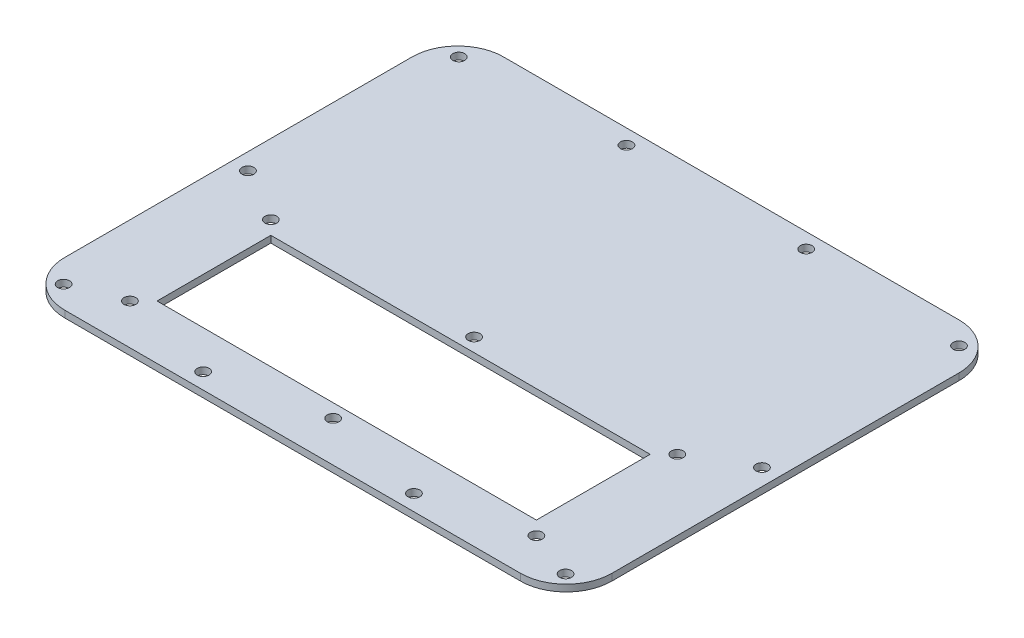
ISO-10303-21;
HEADER;
FILE_DESCRIPTION(('STEP AP214'),'2;1');
FILE_NAME('part.step','',(''),(''),'','','');
FILE_SCHEMA(('AUTOMOTIVE_DESIGN { 1 0 10303 214 1 1 1 1 }'));
ENDSEC;
DATA;
#1=APPLICATION_CONTEXT('core data for automotive mechanical design processes');
#2=APPLICATION_PROTOCOL_DEFINITION('international standard','automotive_design',2000,#1);
#3=PRODUCT_CONTEXT('',#1,'mechanical');
#4=PRODUCT('Part','Part','',(#3));
#5=PRODUCT_RELATED_PRODUCT_CATEGORY('part','',(#4));
#6=PRODUCT_DEFINITION_FORMATION('','',#4);
#7=PRODUCT_DEFINITION_CONTEXT('part definition',#1,'design');
#8=PRODUCT_DEFINITION('design','',#6,#7);
#9=PRODUCT_DEFINITION_SHAPE('','',#8);
#10=(LENGTH_UNIT() NAMED_UNIT(*) SI_UNIT(.MILLI.,.METRE.));
#11=(NAMED_UNIT(*) PLANE_ANGLE_UNIT() SI_UNIT($,.RADIAN.));
#12=(NAMED_UNIT(*) SI_UNIT($,.STERADIAN.) SOLID_ANGLE_UNIT());
#13=UNCERTAINTY_MEASURE_WITH_UNIT(LENGTH_MEASURE(1.E-05),#10,'distance_accuracy_value','');
#14=(GEOMETRIC_REPRESENTATION_CONTEXT(3) GLOBAL_UNCERTAINTY_ASSIGNED_CONTEXT((#13)) GLOBAL_UNIT_ASSIGNED_CONTEXT((#10,
#11,#12)) REPRESENTATION_CONTEXT('',''));
#15=CARTESIAN_POINT('',(0.,0.,0.));
#16=DIRECTION('',(0.,0.,1.));
#17=DIRECTION('',(1.,0.,0.));
#18=AXIS2_PLACEMENT_3D('',#15,#16,#17);
#19=CARTESIAN_POINT('',(-106.7689,3.175,81.3689000000001));
#20=DIRECTION('',(0.,-1.,0.));
#21=DIRECTION('',(0.,0.,-1.));
#22=AXIS2_PLACEMENT_3D('',#19,#20,#21);
#23=PLANE('',#22);
#24=CARTESIAN_POINT('',(-95.25,3.175,83.82));
#25=DIRECTION('',(0.,1.,0.));
#26=DIRECTION('',(0.,0.,-1.));
#27=AXIS2_PLACEMENT_3D('',#24,#25,#26);
#28=CIRCLE('',#27,2.7813);
#29=CARTESIAN_POINT('',(-95.25,3.175,81.0387));
#30=VERTEX_POINT('',#29);
#31=EDGE_CURVE('E465',#30,#30,#28,.T.);
#32=ORIENTED_EDGE('',*,*,#31,.F.);
#33=EDGE_LOOP('',(#32));
#34=FACE_BOUND('',#33,.T.);
#35=CARTESIAN_POINT('',(0.,3.175,83.82));
#36=DIRECTION('',(0.,1.,0.));
#37=DIRECTION('',(0.,0.,-1.));
#38=AXIS2_PLACEMENT_3D('',#35,#36,#37);
#39=CIRCLE('',#38,2.7813);
#40=CARTESIAN_POINT('',(0.,3.175,81.0387));
#41=VERTEX_POINT('',#40);
#42=EDGE_CURVE('E459',#41,#41,#39,.T.);
#43=ORIENTED_EDGE('',*,*,#42,.F.);
#44=EDGE_LOOP('',(#43));
#45=FACE_BOUND('',#44,.T.);
#46=CARTESIAN_POINT('',(95.25,3.175,83.82));
#47=DIRECTION('',(0.,1.,0.));
#48=DIRECTION('',(0.,0.,-1.));
#49=AXIS2_PLACEMENT_3D('',#46,#47,#48);
#50=CIRCLE('',#49,2.7813);
#51=CARTESIAN_POINT('',(95.25,3.175,81.0387));
#52=VERTEX_POINT('',#51);
#53=EDGE_CURVE('E453',#52,#52,#50,.T.);
#54=ORIENTED_EDGE('',*,*,#53,.F.);
#55=EDGE_LOOP('',(#54));
#56=FACE_BOUND('',#55,.T.);
#57=CARTESIAN_POINT('',(95.25,3.175,17.78));
#58=DIRECTION('',(0.,1.,0.));
#59=DIRECTION('',(0.,0.,1.));
#60=AXIS2_PLACEMENT_3D('',#57,#58,#59);
#61=CIRCLE('',#60,2.7813);
#62=CARTESIAN_POINT('',(95.25,3.175,20.5613));
#63=VERTEX_POINT('',#62);
#64=EDGE_CURVE('E447',#63,#63,#61,.T.);
#65=ORIENTED_EDGE('',*,*,#64,.F.);
#66=EDGE_LOOP('',(#65));
#67=FACE_BOUND('',#66,.T.);
#68=CARTESIAN_POINT('',(0.,3.175,17.78));
#69=DIRECTION('',(0.,1.,0.));
#70=DIRECTION('',(0.,0.,1.));
#71=AXIS2_PLACEMENT_3D('',#68,#69,#70);
#72=CIRCLE('',#71,2.7813);
#73=CARTESIAN_POINT('',(0.,3.175,20.5613));
#74=VERTEX_POINT('',#73);
#75=EDGE_CURVE('E434',#74,#74,#72,.T.);
#76=ORIENTED_EDGE('',*,*,#75,.F.);
#77=EDGE_LOOP('',(#76));
#78=FACE_BOUND('',#77,.T.);
#79=CARTESIAN_POINT('',(-95.25,3.175,17.78));
#80=DIRECTION('',(0.,1.,0.));
#81=DIRECTION('',(0.,0.,1.));
#82=AXIS2_PLACEMENT_3D('',#79,#80,#81);
#83=CIRCLE('',#82,2.7813);
#84=CARTESIAN_POINT('',(-95.25,3.175,20.5613));
#85=VERTEX_POINT('',#84);
#86=EDGE_CURVE('E160',#85,#85,#83,.T.);
#87=ORIENTED_EDGE('',*,*,#86,.F.);
#88=EDGE_LOOP('',(#87));
#89=FACE_BOUND('',#88,.T.);
#90=CARTESIAN_POINT('',(-42.1132000000002,3.175,-95.7452999999999));
#91=DIRECTION('',(0.,1.,0.));
#92=DIRECTION('',(0.,0.,-1.));
#93=AXIS2_PLACEMENT_3D('',#90,#91,#92);
#94=CIRCLE('',#93,2.7813);
#95=CARTESIAN_POINT('',(-42.1132000000002,3.175,-98.5265999999999));
#96=VERTEX_POINT('',#95);
#97=EDGE_CURVE('E170',#96,#96,#94,.T.);
#98=ORIENTED_EDGE('',*,*,#97,.F.);
#99=EDGE_LOOP('',(#98));
#100=FACE_BOUND('',#99,.T.);
#101=CARTESIAN_POINT('',(-117.221,3.175,-92.2908999999999));
#102=DIRECTION('',(0.,1.,0.));
#103=DIRECTION('',(0.,0.,-1.));
#104=AXIS2_PLACEMENT_3D('',#101,#102,#103);
#105=CIRCLE('',#104,2.7813);
#106=CARTESIAN_POINT('',(-117.221,3.175,-95.0721999999999));
#107=VERTEX_POINT('',#106);
#108=EDGE_CURVE('E176',#107,#107,#105,.T.);
#109=ORIENTED_EDGE('',*,*,#108,.F.);
#110=EDGE_LOOP('',(#109));
#111=FACE_BOUND('',#110,.T.);
#112=CARTESIAN_POINT('',(-120.4468,3.175,3.3147));
#113=DIRECTION('',(0.,1.,0.));
#114=DIRECTION('',(0.,0.,-1.));
#115=AXIS2_PLACEMENT_3D('',#112,#113,#114);
#116=CIRCLE('',#115,2.7813);
#117=CARTESIAN_POINT('',(-120.4468,3.175,0.533400000000007));
#118=VERTEX_POINT('',#117);
#119=EDGE_CURVE('E182',#118,#118,#116,.T.);
#120=ORIENTED_EDGE('',*,*,#119,.F.);
#121=EDGE_LOOP('',(#120));
#122=FACE_BOUND('',#121,.T.);
#123=CARTESIAN_POINT('',(-117.6274,3.175,92.5195));
#124=DIRECTION('',(0.,1.,0.));
#125=DIRECTION('',(0.,0.,-1.));
#126=AXIS2_PLACEMENT_3D('',#123,#124,#125);
#127=CIRCLE('',#126,2.7813);
#128=CARTESIAN_POINT('',(-117.6274,3.175,89.7381999999999));
#129=VERTEX_POINT('',#128);
#130=EDGE_CURVE('E188',#129,#129,#127,.T.);
#131=ORIENTED_EDGE('',*,*,#130,.F.);
#132=EDGE_LOOP('',(#131));
#133=FACE_BOUND('',#132,.T.);
#134=CARTESIAN_POINT('',(-49.4030000000002,3.175,95.3643));
#135=DIRECTION('',(0.,1.,0.));
#136=DIRECTION('',(0.,0.,-1.));
#137=AXIS2_PLACEMENT_3D('',#134,#135,#136);
#138=CIRCLE('',#137,2.7813);
#139=CARTESIAN_POINT('',(-49.4030000000002,3.175,92.583));
#140=VERTEX_POINT('',#139);
#141=EDGE_CURVE('E194',#140,#140,#138,.T.);
#142=ORIENTED_EDGE('',*,*,#141,.F.);
#143=EDGE_LOOP('',(#142));
#144=FACE_BOUND('',#143,.T.);
#145=CARTESIAN_POINT('',(49.403,3.175,95.3643));
#146=DIRECTION('',(0.,1.,0.));
#147=DIRECTION('',(0.,0.,1.));
#148=AXIS2_PLACEMENT_3D('',#145,#146,#147);
#149=CIRCLE('',#148,2.7813);
#150=CARTESIAN_POINT('',(49.403,3.175,98.1456));
#151=VERTEX_POINT('',#150);
#152=EDGE_CURVE('E200',#151,#151,#149,.T.);
#153=ORIENTED_EDGE('',*,*,#152,.F.);
#154=EDGE_LOOP('',(#153));
#155=FACE_BOUND('',#154,.T.);
#156=CARTESIAN_POINT('',(120.4468,3.175,3.3147));
#157=DIRECTION('',(0.,1.,0.));
#158=DIRECTION('',(0.,0.,1.));
#159=AXIS2_PLACEMENT_3D('',#156,#157,#158);
#160=CIRCLE('',#159,2.7813);
#161=CARTESIAN_POINT('',(120.4468,3.175,6.096));
#162=VERTEX_POINT('',#161);
#163=EDGE_CURVE('E206',#162,#162,#160,.T.);
#164=ORIENTED_EDGE('',*,*,#163,.F.);
#165=EDGE_LOOP('',(#164));
#166=FACE_BOUND('',#165,.T.);
#167=CARTESIAN_POINT('',(117.6274,3.175,92.5195));
#168=DIRECTION('',(0.,1.,0.));
#169=DIRECTION('',(0.,0.,1.));
#170=AXIS2_PLACEMENT_3D('',#167,#168,#169);
#171=CIRCLE('',#170,2.7813);
#172=CARTESIAN_POINT('',(117.6274,3.175,95.3008));
#173=VERTEX_POINT('',#172);
#174=EDGE_CURVE('E212',#173,#173,#171,.T.);
#175=ORIENTED_EDGE('',*,*,#174,.F.);
#176=EDGE_LOOP('',(#175));
#177=FACE_BOUND('',#176,.T.);
#178=CARTESIAN_POINT('',(117.221,3.175,-92.2909));
#179=DIRECTION('',(0.,1.,0.));
#180=DIRECTION('',(0.,0.,1.));
#181=AXIS2_PLACEMENT_3D('',#178,#179,#180);
#182=CIRCLE('',#181,2.7813);
#183=CARTESIAN_POINT('',(117.221,3.175,-89.5096));
#184=VERTEX_POINT('',#183);
#185=EDGE_CURVE('E218',#184,#184,#182,.T.);
#186=ORIENTED_EDGE('',*,*,#185,.F.);
#187=EDGE_LOOP('',(#186));
#188=FACE_BOUND('',#187,.T.);
#189=CARTESIAN_POINT('',(42.1132,3.175,-95.7453));
#190=DIRECTION('',(0.,1.,0.));
#191=DIRECTION('',(0.,0.,1.));
#192=AXIS2_PLACEMENT_3D('',#189,#190,#191);
#193=CIRCLE('',#192,2.7813);
#194=CARTESIAN_POINT('',(42.1132,3.175,-92.964));
#195=VERTEX_POINT('',#194);
#196=EDGE_CURVE('E224',#195,#195,#193,.T.);
#197=ORIENTED_EDGE('',*,*,#196,.F.);
#198=EDGE_LOOP('',(#197));
#199=FACE_BOUND('',#198,.T.);
#200=CARTESIAN_POINT('',(-106.7689,3.175,81.3689000000001));
#201=DIRECTION('',(0.,1.,0.));
#202=DIRECTION('',(0.,0.,-1.));
#203=AXIS2_PLACEMENT_3D('',#200,#201,#202);
#204=CIRCLE('',#203,21.4376);
#205=CARTESIAN_POINT('',(-128.2065,3.175,81.3688999999999));
#206=VERTEX_POINT('',#205);
#207=CARTESIAN_POINT('',(-106.7689,3.175,102.8065));
#208=VERTEX_POINT('',#207);
#209=EDGE_CURVE('E230',#206,#208,#204,.T.);
#210=ORIENTED_EDGE('',*,*,#209,.T.);
#211=DIRECTION('',(1.,0.,0.));
#212=VECTOR('',#211,1.);
#213=CARTESIAN_POINT('',(-106.7689,3.175,102.8065));
#214=LINE('',#213,#212);
#215=CARTESIAN_POINT('',(106.7689,3.175,102.8065));
#216=VERTEX_POINT('',#215);
#217=EDGE_CURVE('E233',#208,#216,#214,.T.);
#218=ORIENTED_EDGE('',*,*,#217,.T.);
#219=CARTESIAN_POINT('',(106.7689,3.175,81.3689000000001));
#220=DIRECTION('',(0.,1.,0.));
#221=DIRECTION('',(0.,0.,1.));
#222=AXIS2_PLACEMENT_3D('',#219,#220,#221);
#223=CIRCLE('',#222,21.4376);
#224=CARTESIAN_POINT('',(128.2065,3.175,81.3688999999999));
#225=VERTEX_POINT('',#224);
#226=EDGE_CURVE('E236',#216,#225,#223,.T.);
#227=ORIENTED_EDGE('',*,*,#226,.T.);
#228=DIRECTION('',(0.,0.,-1.));
#229=VECTOR('',#228,1.);
#230=CARTESIAN_POINT('',(128.2065,3.175,81.3688999999999));
#231=LINE('',#230,#229);
#232=CARTESIAN_POINT('',(128.2065,3.175,-81.3688999999998));
#233=VERTEX_POINT('',#232);
#234=EDGE_CURVE('E238',#225,#233,#231,.T.);
#235=ORIENTED_EDGE('',*,*,#234,.T.);
#236=CARTESIAN_POINT('',(106.7689,3.175,-81.3689));
#237=DIRECTION('',(0.,1.,0.));
#238=DIRECTION('',(0.,0.,-1.));
#239=AXIS2_PLACEMENT_3D('',#236,#237,#238);
#240=CIRCLE('',#239,21.4376);
#241=CARTESIAN_POINT('',(106.7689,3.175,-102.8065));
#242=VERTEX_POINT('',#241);
#243=EDGE_CURVE('E240',#233,#242,#240,.T.);
#244=ORIENTED_EDGE('',*,*,#243,.T.);
#245=DIRECTION('',(-1.,0.,0.));
#246=VECTOR('',#245,1.);
#247=CARTESIAN_POINT('',(-106.7689,3.175,-102.8065));
#248=LINE('',#247,#246);
#249=CARTESIAN_POINT('',(-106.7689,3.175,-102.8065));
#250=VERTEX_POINT('',#249);
#251=EDGE_CURVE('E242',#242,#250,#248,.T.);
#252=ORIENTED_EDGE('',*,*,#251,.T.);
#253=CARTESIAN_POINT('',(-106.7689,3.175,-81.3689));
#254=DIRECTION('',(0.,1.,0.));
#255=DIRECTION('',(0.,0.,-1.));
#256=AXIS2_PLACEMENT_3D('',#253,#254,#255);
#257=CIRCLE('',#256,21.4376);
#258=CARTESIAN_POINT('',(-128.2065,3.175,-81.3688999999998));
#259=VERTEX_POINT('',#258);
#260=EDGE_CURVE('E244',#250,#259,#257,.T.);
#261=ORIENTED_EDGE('',*,*,#260,.T.);
#262=DIRECTION('',(0.,0.,1.));
#263=VECTOR('',#262,1.);
#264=CARTESIAN_POINT('',(-128.2065,3.175,81.3688999999999));
#265=LINE('',#264,#263);
#266=EDGE_CURVE('E246',#259,#206,#265,.T.);
#267=ORIENTED_EDGE('',*,*,#266,.T.);
#268=EDGE_LOOP('',(#210,#218,#227,#235,#244,#252,#261,#267));
#269=FACE_BOUND('',#268,.T.);
#270=DIRECTION('',(0.,0.,-1.));
#271=VECTOR('',#270,1.);
#272=CARTESIAN_POINT('',(88.9,3.175,24.13));
#273=LINE('',#272,#271);
#274=CARTESIAN_POINT('',(88.9,3.175,77.47));
#275=VERTEX_POINT('',#274);
#276=CARTESIAN_POINT('',(88.9,3.175,24.13));
#277=VERTEX_POINT('',#276);
#278=EDGE_CURVE('E132',#275,#277,#273,.T.);
#279=ORIENTED_EDGE('',*,*,#278,.F.);
#280=DIRECTION('',(1.,0.,0.));
#281=VECTOR('',#280,1.);
#282=CARTESIAN_POINT('',(-88.9,3.175,77.47));
#283=LINE('',#282,#281);
#284=CARTESIAN_POINT('',(-88.9,3.175,77.47));
#285=VERTEX_POINT('',#284);
#286=EDGE_CURVE('E154',#285,#275,#283,.T.);
#287=ORIENTED_EDGE('',*,*,#286,.F.);
#288=DIRECTION('',(0.,0.,1.));
#289=VECTOR('',#288,1.);
#290=CARTESIAN_POINT('',(-88.9,3.175,24.13));
#291=LINE('',#290,#289);
#292=CARTESIAN_POINT('',(-88.9,3.175,24.13));
#293=VERTEX_POINT('',#292);
#294=EDGE_CURVE('E152',#293,#285,#291,.T.);
#295=ORIENTED_EDGE('',*,*,#294,.F.);
#296=DIRECTION('',(-1.,0.,0.));
#297=VECTOR('',#296,1.);
#298=CARTESIAN_POINT('',(-88.9,3.175,24.13));
#299=LINE('',#298,#297);
#300=EDGE_CURVE('E140',#277,#293,#299,.T.);
#301=ORIENTED_EDGE('',*,*,#300,.F.);
#302=EDGE_LOOP('',(#279,#287,#295,#301));
#303=FACE_BOUND('',#302,.T.);
#304=ADVANCED_FACE('F43',(#34,#45,#56,#67,#78,#89,#100,#111,#122,#133,#144,#155,#166,#177,#188,
#199,#269,#303),#23,.F.);
#305=CARTESIAN_POINT('',(-106.7689,0.,81.3689000000001));
#306=DIRECTION('',(0.,-1.,0.));
#307=DIRECTION('',(0.,0.,-1.));
#308=AXIS2_PLACEMENT_3D('',#305,#306,#307);
#309=PLANE('',#308);
#310=CARTESIAN_POINT('',(-95.25,0.,83.82));
#311=DIRECTION('',(0.,1.,0.));
#312=DIRECTION('',(0.,0.,-1.));
#313=AXIS2_PLACEMENT_3D('',#310,#311,#312);
#314=CIRCLE('',#313,2.7813);
#315=CARTESIAN_POINT('',(-95.25,0.,81.0387));
#316=VERTEX_POINT('',#315);
#317=EDGE_CURVE('E462',#316,#316,#314,.T.);
#318=ORIENTED_EDGE('',*,*,#317,.T.);
#319=EDGE_LOOP('',(#318));
#320=FACE_BOUND('',#319,.T.);
#321=CARTESIAN_POINT('',(0.,0.,83.82));
#322=DIRECTION('',(0.,1.,0.));
#323=DIRECTION('',(0.,0.,-1.));
#324=AXIS2_PLACEMENT_3D('',#321,#322,#323);
#325=CIRCLE('',#324,2.7813);
#326=CARTESIAN_POINT('',(0.,0.,81.0387));
#327=VERTEX_POINT('',#326);
#328=EDGE_CURVE('E456',#327,#327,#325,.T.);
#329=ORIENTED_EDGE('',*,*,#328,.T.);
#330=EDGE_LOOP('',(#329));
#331=FACE_BOUND('',#330,.T.);
#332=CARTESIAN_POINT('',(95.25,0.,83.82));
#333=DIRECTION('',(0.,1.,0.));
#334=DIRECTION('',(0.,0.,-1.));
#335=AXIS2_PLACEMENT_3D('',#332,#333,#334);
#336=CIRCLE('',#335,2.7813);
#337=CARTESIAN_POINT('',(95.25,0.,81.0387));
#338=VERTEX_POINT('',#337);
#339=EDGE_CURVE('E450',#338,#338,#336,.T.);
#340=ORIENTED_EDGE('',*,*,#339,.T.);
#341=EDGE_LOOP('',(#340));
#342=FACE_BOUND('',#341,.T.);
#343=CARTESIAN_POINT('',(95.25,0.,17.78));
#344=DIRECTION('',(0.,1.,0.));
#345=DIRECTION('',(0.,0.,1.));
#346=AXIS2_PLACEMENT_3D('',#343,#344,#345);
#347=CIRCLE('',#346,2.7813);
#348=CARTESIAN_POINT('',(95.25,0.,20.5613));
#349=VERTEX_POINT('',#348);
#350=EDGE_CURVE('E442',#349,#349,#347,.T.);
#351=ORIENTED_EDGE('',*,*,#350,.T.);
#352=EDGE_LOOP('',(#351));
#353=FACE_BOUND('',#352,.T.);
#354=CARTESIAN_POINT('',(0.,0.,17.78));
#355=DIRECTION('',(0.,1.,0.));
#356=DIRECTION('',(0.,0.,1.));
#357=AXIS2_PLACEMENT_3D('',#354,#355,#356);
#358=CIRCLE('',#357,2.7813);
#359=CARTESIAN_POINT('',(0.,0.,20.5613));
#360=VERTEX_POINT('',#359);
#361=EDGE_CURVE('E437',#360,#360,#358,.T.);
#362=ORIENTED_EDGE('',*,*,#361,.T.);
#363=EDGE_LOOP('',(#362));
#364=FACE_BOUND('',#363,.T.);
#365=CARTESIAN_POINT('',(-95.25,0.,17.78));
#366=DIRECTION('',(0.,1.,0.));
#367=DIRECTION('',(0.,0.,1.));
#368=AXIS2_PLACEMENT_3D('',#365,#366,#367);
#369=CIRCLE('',#368,2.7813);
#370=CARTESIAN_POINT('',(-95.25,0.,20.5613));
#371=VERTEX_POINT('',#370);
#372=EDGE_CURVE('E439',#371,#371,#369,.T.);
#373=ORIENTED_EDGE('',*,*,#372,.T.);
#374=EDGE_LOOP('',(#373));
#375=FACE_BOUND('',#374,.T.);
#376=CARTESIAN_POINT('',(-117.221,0.,-92.2908999999999));
#377=DIRECTION('',(0.,1.,0.));
#378=DIRECTION('',(0.,0.,-1.));
#379=AXIS2_PLACEMENT_3D('',#376,#377,#378);
#380=CIRCLE('',#379,2.7813);
#381=CARTESIAN_POINT('',(-117.221,0.,-95.0721999999999));
#382=VERTEX_POINT('',#381);
#383=EDGE_CURVE('E173',#382,#382,#380,.T.);
#384=ORIENTED_EDGE('',*,*,#383,.T.);
#385=EDGE_LOOP('',(#384));
#386=FACE_BOUND('',#385,.T.);
#387=CARTESIAN_POINT('',(-117.6274,0.,92.5195));
#388=DIRECTION('',(0.,1.,0.));
#389=DIRECTION('',(0.,0.,-1.));
#390=AXIS2_PLACEMENT_3D('',#387,#388,#389);
#391=CIRCLE('',#390,2.7813);
#392=CARTESIAN_POINT('',(-117.6274,0.,89.7381999999999));
#393=VERTEX_POINT('',#392);
#394=EDGE_CURVE('E185',#393,#393,#391,.T.);
#395=ORIENTED_EDGE('',*,*,#394,.T.);
#396=EDGE_LOOP('',(#395));
#397=FACE_BOUND('',#396,.T.);
#398=CARTESIAN_POINT('',(49.403,0.,95.3643));
#399=DIRECTION('',(0.,1.,0.));
#400=DIRECTION('',(0.,0.,1.));
#401=AXIS2_PLACEMENT_3D('',#398,#399,#400);
#402=CIRCLE('',#401,2.7813);
#403=CARTESIAN_POINT('',(49.403,0.,98.1456));
#404=VERTEX_POINT('',#403);
#405=EDGE_CURVE('E197',#404,#404,#402,.T.);
#406=ORIENTED_EDGE('',*,*,#405,.T.);
#407=EDGE_LOOP('',(#406));
#408=FACE_BOUND('',#407,.T.);
#409=CARTESIAN_POINT('',(117.6274,0.,92.5195));
#410=DIRECTION('',(0.,1.,0.));
#411=DIRECTION('',(0.,0.,1.));
#412=AXIS2_PLACEMENT_3D('',#409,#410,#411);
#413=CIRCLE('',#412,2.7813);
#414=CARTESIAN_POINT('',(117.6274,0.,95.3008));
#415=VERTEX_POINT('',#414);
#416=EDGE_CURVE('E209',#415,#415,#413,.T.);
#417=ORIENTED_EDGE('',*,*,#416,.T.);
#418=EDGE_LOOP('',(#417));
#419=FACE_BOUND('',#418,.T.);
#420=CARTESIAN_POINT('',(42.1132,0.,-95.7453));
#421=DIRECTION('',(0.,1.,0.));
#422=DIRECTION('',(0.,0.,1.));
#423=AXIS2_PLACEMENT_3D('',#420,#421,#422);
#424=CIRCLE('',#423,2.7813);
#425=CARTESIAN_POINT('',(42.1132,0.,-92.964));
#426=VERTEX_POINT('',#425);
#427=EDGE_CURVE('E221',#426,#426,#424,.T.);
#428=ORIENTED_EDGE('',*,*,#427,.T.);
#429=EDGE_LOOP('',(#428));
#430=FACE_BOUND('',#429,.T.);
#431=CARTESIAN_POINT('',(-106.7689,0.,81.3689000000001));
#432=DIRECTION('',(0.,1.,0.));
#433=DIRECTION('',(0.,0.,-1.));
#434=AXIS2_PLACEMENT_3D('',#431,#432,#433);
#435=CIRCLE('',#434,21.4376);
#436=CARTESIAN_POINT('',(-128.2065,0.,81.3688999999999));
#437=VERTEX_POINT('',#436);
#438=CARTESIAN_POINT('',(-106.7689,0.,102.8065));
#439=VERTEX_POINT('',#438);
#440=EDGE_CURVE('E227',#437,#439,#435,.T.);
#441=ORIENTED_EDGE('',*,*,#440,.F.);
#442=DIRECTION('',(0.,0.,1.));
#443=VECTOR('',#442,1.);
#444=CARTESIAN_POINT('',(-128.2065,0.,81.3688999999999));
#445=LINE('',#444,#443);
#446=CARTESIAN_POINT('',(-128.2065,0.,-81.3688999999998));
#447=VERTEX_POINT('',#446);
#448=EDGE_CURVE('E234',#447,#437,#445,.T.);
#449=ORIENTED_EDGE('',*,*,#448,.F.);
#450=CARTESIAN_POINT('',(-106.7689,0.,-81.3689));
#451=DIRECTION('',(0.,1.,0.));
#452=DIRECTION('',(0.,0.,-1.));
#453=AXIS2_PLACEMENT_3D('',#450,#451,#452);
#454=CIRCLE('',#453,21.4376);
#455=CARTESIAN_POINT('',(-106.7689,0.,-102.8065));
#456=VERTEX_POINT('',#455);
#457=EDGE_CURVE('E261',#456,#447,#454,.T.);
#458=ORIENTED_EDGE('',*,*,#457,.F.);
#459=DIRECTION('',(-1.,0.,0.));
#460=VECTOR('',#459,1.);
#461=CARTESIAN_POINT('',(-106.7689,0.,-102.8065));
#462=LINE('',#461,#460);
#463=CARTESIAN_POINT('',(106.7689,0.,-102.8065));
#464=VERTEX_POINT('',#463);
#465=EDGE_CURVE('E259',#464,#456,#462,.T.);
#466=ORIENTED_EDGE('',*,*,#465,.F.);
#467=CARTESIAN_POINT('',(106.7689,0.,-81.3689));
#468=DIRECTION('',(0.,1.,0.));
#469=DIRECTION('',(0.,0.,-1.));
#470=AXIS2_PLACEMENT_3D('',#467,#468,#469);
#471=CIRCLE('',#470,21.4376);
#472=CARTESIAN_POINT('',(128.2065,0.,-81.3688999999998));
#473=VERTEX_POINT('',#472);
#474=EDGE_CURVE('E257',#473,#464,#471,.T.);
#475=ORIENTED_EDGE('',*,*,#474,.F.);
#476=DIRECTION('',(0.,0.,-1.));
#477=VECTOR('',#476,1.);
#478=CARTESIAN_POINT('',(128.2065,0.,81.3688999999999));
#479=LINE('',#478,#477);
#480=CARTESIAN_POINT('',(128.2065,0.,81.3688999999999));
#481=VERTEX_POINT('',#480);
#482=EDGE_CURVE('E255',#481,#473,#479,.T.);
#483=ORIENTED_EDGE('',*,*,#482,.F.);
#484=CARTESIAN_POINT('',(106.7689,0.,81.3689000000001));
#485=DIRECTION('',(0.,1.,0.));
#486=DIRECTION('',(0.,0.,1.));
#487=AXIS2_PLACEMENT_3D('',#484,#485,#486);
#488=CIRCLE('',#487,21.4376);
#489=CARTESIAN_POINT('',(106.7689,0.,102.8065));
#490=VERTEX_POINT('',#489);
#491=EDGE_CURVE('E253',#490,#481,#488,.T.);
#492=ORIENTED_EDGE('',*,*,#491,.F.);
#493=DIRECTION('',(1.,0.,0.));
#494=VECTOR('',#493,1.);
#495=CARTESIAN_POINT('',(-106.7689,0.,102.8065));
#496=LINE('',#495,#494);
#497=EDGE_CURVE('E251',#439,#490,#496,.T.);
#498=ORIENTED_EDGE('',*,*,#497,.F.);
#499=EDGE_LOOP('',(#441,#449,#458,#466,#475,#483,#492,#498));
#500=FACE_BOUND('',#499,.T.);
#501=CARTESIAN_POINT('',(117.221,0.,-92.2909));
#502=DIRECTION('',(0.,1.,0.));
#503=DIRECTION('',(0.,0.,1.));
#504=AXIS2_PLACEMENT_3D('',#501,#502,#503);
#505=CIRCLE('',#504,2.7813);
#506=CARTESIAN_POINT('',(117.221,0.,-89.5096));
#507=VERTEX_POINT('',#506);
#508=EDGE_CURVE('E215',#507,#507,#505,.T.);
#509=ORIENTED_EDGE('',*,*,#508,.T.);
#510=EDGE_LOOP('',(#509));
#511=FACE_BOUND('',#510,.T.);
#512=CARTESIAN_POINT('',(120.4468,0.,3.3147));
#513=DIRECTION('',(0.,1.,0.));
#514=DIRECTION('',(0.,0.,1.));
#515=AXIS2_PLACEMENT_3D('',#512,#513,#514);
#516=CIRCLE('',#515,2.7813);
#517=CARTESIAN_POINT('',(120.4468,0.,6.096));
#518=VERTEX_POINT('',#517);
#519=EDGE_CURVE('E203',#518,#518,#516,.T.);
#520=ORIENTED_EDGE('',*,*,#519,.T.);
#521=EDGE_LOOP('',(#520));
#522=FACE_BOUND('',#521,.T.);
#523=CARTESIAN_POINT('',(-49.4030000000002,0.,95.3643));
#524=DIRECTION('',(0.,1.,0.));
#525=DIRECTION('',(0.,0.,-1.));
#526=AXIS2_PLACEMENT_3D('',#523,#524,#525);
#527=CIRCLE('',#526,2.7813);
#528=CARTESIAN_POINT('',(-49.4030000000002,0.,92.583));
#529=VERTEX_POINT('',#528);
#530=EDGE_CURVE('E191',#529,#529,#527,.T.);
#531=ORIENTED_EDGE('',*,*,#530,.T.);
#532=EDGE_LOOP('',(#531));
#533=FACE_BOUND('',#532,.T.);
#534=CARTESIAN_POINT('',(-120.4468,0.,3.3147));
#535=DIRECTION('',(0.,1.,0.));
#536=DIRECTION('',(0.,0.,-1.));
#537=AXIS2_PLACEMENT_3D('',#534,#535,#536);
#538=CIRCLE('',#537,2.7813);
#539=CARTESIAN_POINT('',(-120.4468,0.,0.533400000000007));
#540=VERTEX_POINT('',#539);
#541=EDGE_CURVE('E179',#540,#540,#538,.T.);
#542=ORIENTED_EDGE('',*,*,#541,.T.);
#543=EDGE_LOOP('',(#542));
#544=FACE_BOUND('',#543,.T.);
#545=CARTESIAN_POINT('',(-42.1132000000002,0.,-95.7452999999999));
#546=DIRECTION('',(0.,1.,0.));
#547=DIRECTION('',(0.,0.,-1.));
#548=AXIS2_PLACEMENT_3D('',#545,#546,#547);
#549=CIRCLE('',#548,2.7813);
#550=CARTESIAN_POINT('',(-42.1132000000002,0.,-98.5265999999999));
#551=VERTEX_POINT('',#550);
#552=EDGE_CURVE('E148',#551,#551,#549,.T.);
#553=ORIENTED_EDGE('',*,*,#552,.T.);
#554=EDGE_LOOP('',(#553));
#555=FACE_BOUND('',#554,.T.);
#556=DIRECTION('',(1.,0.,0.));
#557=VECTOR('',#556,1.);
#558=CARTESIAN_POINT('',(-88.9,0.,77.47));
#559=LINE('',#558,#557);
#560=CARTESIAN_POINT('',(-88.9,0.,77.47));
#561=VERTEX_POINT('',#560);
#562=CARTESIAN_POINT('',(88.9,0.,77.47));
#563=VERTEX_POINT('',#562);
#564=EDGE_CURVE('E141',#561,#563,#559,.T.);
#565=ORIENTED_EDGE('',*,*,#564,.T.);
#566=DIRECTION('',(0.,0.,-1.));
#567=VECTOR('',#566,1.);
#568=CARTESIAN_POINT('',(88.9,0.,24.13));
#569=LINE('',#568,#567);
#570=CARTESIAN_POINT('',(88.9,0.,24.13));
#571=VERTEX_POINT('',#570);
#572=EDGE_CURVE('E66',#563,#571,#569,.T.);
#573=ORIENTED_EDGE('',*,*,#572,.T.);
#574=DIRECTION('',(-1.,0.,0.));
#575=VECTOR('',#574,1.);
#576=CARTESIAN_POINT('',(-88.9,0.,24.13));
#577=LINE('',#576,#575);
#578=CARTESIAN_POINT('',(-88.9,0.,24.13));
#579=VERTEX_POINT('',#578);
#580=EDGE_CURVE('E147',#571,#579,#577,.T.);
#581=ORIENTED_EDGE('',*,*,#580,.T.);
#582=DIRECTION('',(0.,0.,1.));
#583=VECTOR('',#582,1.);
#584=CARTESIAN_POINT('',(-88.9,0.,24.13));
#585=LINE('',#584,#583);
#586=EDGE_CURVE('E162',#579,#561,#585,.T.);
#587=ORIENTED_EDGE('',*,*,#586,.T.);
#588=EDGE_LOOP('',(#565,#573,#581,#587));
#589=FACE_BOUND('',#588,.T.);
#590=ADVANCED_FACE('F291',(#320,#331,#342,#353,#364,#375,#386,#397,#408,#419,#430,#500,#511,
#522,#533,#544,#555,#589),#309,.T.);
#591=CARTESIAN_POINT('',(-106.7689,3.175,81.3689000000001));
#592=DIRECTION('',(0.,-1.,0.));
#593=DIRECTION('',(0.,0.,-1.));
#594=AXIS2_PLACEMENT_3D('',#591,#592,#593);
#595=CYLINDRICAL_SURFACE('',#594,21.4376);
#596=ORIENTED_EDGE('',*,*,#440,.T.);
#597=DIRECTION('',(0.,-1.,0.));
#598=VECTOR('',#597,1.);
#599=CARTESIAN_POINT('',(-106.7689,3.175,102.8065));
#600=LINE('',#599,#598);
#601=EDGE_CURVE('E11',#208,#439,#600,.T.);
#602=ORIENTED_EDGE('',*,*,#601,.F.);
#603=ORIENTED_EDGE('',*,*,#209,.F.);
#604=DIRECTION('',(0.,-1.,0.));
#605=VECTOR('',#604,1.);
#606=CARTESIAN_POINT('',(-128.2065,3.175,81.3688999999999));
#607=LINE('',#606,#605);
#608=EDGE_CURVE('E248',#206,#437,#607,.T.);
#609=ORIENTED_EDGE('',*,*,#608,.T.);
#610=EDGE_LOOP('',(#596,#602,#603,#609));
#611=FACE_BOUND('',#610,.T.);
#612=ADVANCED_FACE('F45',(#611),#595,.T.);
#613=CARTESIAN_POINT('',(-106.7689,3.175,102.8065));
#614=DIRECTION('',(0.,0.,-1.));
#615=DIRECTION('',(-1.,0.,0.));
#616=AXIS2_PLACEMENT_3D('',#613,#614,#615);
#617=PLANE('',#616);
#618=ORIENTED_EDGE('',*,*,#497,.T.);
#619=DIRECTION('',(0.,-1.,0.));
#620=VECTOR('',#619,1.);
#621=CARTESIAN_POINT('',(106.7689,3.175,102.8065));
#622=LINE('',#621,#620);
#623=EDGE_CURVE('E51',#216,#490,#622,.T.);
#624=ORIENTED_EDGE('',*,*,#623,.F.);
#625=ORIENTED_EDGE('',*,*,#217,.F.);
#626=ORIENTED_EDGE('',*,*,#601,.T.);
#627=EDGE_LOOP('',(#618,#624,#625,#626));
#628=FACE_BOUND('',#627,.T.);
#629=ADVANCED_FACE('F308',(#628),#617,.F.);
#630=CARTESIAN_POINT('',(106.7689,3.175,81.3689000000001));
#631=DIRECTION('',(0.,-1.,0.));
#632=DIRECTION('',(0.,0.,-1.));
#633=AXIS2_PLACEMENT_3D('',#630,#631,#632);
#634=CYLINDRICAL_SURFACE('',#633,21.4376);
#635=ORIENTED_EDGE('',*,*,#491,.T.);
#636=DIRECTION('',(0.,-1.,0.));
#637=VECTOR('',#636,1.);
#638=CARTESIAN_POINT('',(128.2065,3.175,81.3688999999999));
#639=LINE('',#638,#637);
#640=EDGE_CURVE('E278',#225,#481,#639,.T.);
#641=ORIENTED_EDGE('',*,*,#640,.F.);
#642=ORIENTED_EDGE('',*,*,#226,.F.);
#643=ORIENTED_EDGE('',*,*,#623,.T.);
#644=EDGE_LOOP('',(#635,#641,#642,#643));
#645=FACE_BOUND('',#644,.T.);
#646=ADVANCED_FACE('F285',(#645),#634,.T.);
#647=CARTESIAN_POINT('',(128.2065,3.175,81.3688999999999));
#648=DIRECTION('',(-1.,0.,0.));
#649=DIRECTION('',(0.,0.,1.));
#650=AXIS2_PLACEMENT_3D('',#647,#648,#649);
#651=PLANE('',#650);
#652=ORIENTED_EDGE('',*,*,#482,.T.);
#653=DIRECTION('',(0.,-1.,0.));
#654=VECTOR('',#653,1.);
#655=CARTESIAN_POINT('',(128.2065,3.175,-81.3688999999998));
#656=LINE('',#655,#654);
#657=EDGE_CURVE('E275',#233,#473,#656,.T.);
#658=ORIENTED_EDGE('',*,*,#657,.F.);
#659=ORIENTED_EDGE('',*,*,#234,.F.);
#660=ORIENTED_EDGE('',*,*,#640,.T.);
#661=EDGE_LOOP('',(#652,#658,#659,#660));
#662=FACE_BOUND('',#661,.T.);
#663=ADVANCED_FACE('F297',(#662),#651,.F.);
#664=CARTESIAN_POINT('',(106.7689,3.175,-81.3689));
#665=DIRECTION('',(0.,-1.,0.));
#666=DIRECTION('',(0.,0.,-1.));
#667=AXIS2_PLACEMENT_3D('',#664,#665,#666);
#668=CYLINDRICAL_SURFACE('',#667,21.4376);
#669=ORIENTED_EDGE('',*,*,#474,.T.);
#670=DIRECTION('',(0.,-1.,0.));
#671=VECTOR('',#670,1.);
#672=CARTESIAN_POINT('',(106.7689,3.175,-102.8065));
#673=LINE('',#672,#671);
#674=EDGE_CURVE('E272',#242,#464,#673,.T.);
#675=ORIENTED_EDGE('',*,*,#674,.F.);
#676=ORIENTED_EDGE('',*,*,#243,.F.);
#677=ORIENTED_EDGE('',*,*,#657,.T.);
#678=EDGE_LOOP('',(#669,#675,#676,#677));
#679=FACE_BOUND('',#678,.T.);
#680=ADVANCED_FACE('F301',(#679),#668,.T.);
#681=CARTESIAN_POINT('',(-106.7689,3.175,-102.8065));
#682=DIRECTION('',(0.,0.,1.));
#683=DIRECTION('',(1.,0.,0.));
#684=AXIS2_PLACEMENT_3D('',#681,#682,#683);
#685=PLANE('',#684);
#686=ORIENTED_EDGE('',*,*,#465,.T.);
#687=DIRECTION('',(0.,-1.,0.));
#688=VECTOR('',#687,1.);
#689=CARTESIAN_POINT('',(-106.7689,3.175,-102.8065));
#690=LINE('',#689,#688);
#691=EDGE_CURVE('E269',#250,#456,#690,.T.);
#692=ORIENTED_EDGE('',*,*,#691,.F.);
#693=ORIENTED_EDGE('',*,*,#251,.F.);
#694=ORIENTED_EDGE('',*,*,#674,.T.);
#695=EDGE_LOOP('',(#686,#692,#693,#694));
#696=FACE_BOUND('',#695,.T.);
#697=ADVANCED_FACE('F321',(#696),#685,.F.);
#698=CARTESIAN_POINT('',(-106.7689,3.175,-81.3689));
#699=DIRECTION('',(0.,-1.,0.));
#700=DIRECTION('',(0.,0.,-1.));
#701=AXIS2_PLACEMENT_3D('',#698,#699,#700);
#702=CYLINDRICAL_SURFACE('',#701,21.4376);
#703=ORIENTED_EDGE('',*,*,#457,.T.);
#704=DIRECTION('',(0.,-1.,0.));
#705=VECTOR('',#704,1.);
#706=CARTESIAN_POINT('',(-128.2065,3.175,-81.3688999999998));
#707=LINE('',#706,#705);
#708=EDGE_CURVE('E266',#259,#447,#707,.T.);
#709=ORIENTED_EDGE('',*,*,#708,.F.);
#710=ORIENTED_EDGE('',*,*,#260,.F.);
#711=ORIENTED_EDGE('',*,*,#691,.T.);
#712=EDGE_LOOP('',(#703,#709,#710,#711));
#713=FACE_BOUND('',#712,.T.);
#714=ADVANCED_FACE('F319',(#713),#702,.T.);
#715=CARTESIAN_POINT('',(-128.2065,3.175,81.3688999999999));
#716=DIRECTION('',(1.,0.,0.));
#717=DIRECTION('',(0.,0.,-1.));
#718=AXIS2_PLACEMENT_3D('',#715,#716,#717);
#719=PLANE('',#718);
#720=ORIENTED_EDGE('',*,*,#448,.T.);
#721=ORIENTED_EDGE('',*,*,#608,.F.);
#722=ORIENTED_EDGE('',*,*,#266,.F.);
#723=ORIENTED_EDGE('',*,*,#708,.T.);
#724=EDGE_LOOP('',(#720,#721,#722,#723));
#725=FACE_BOUND('',#724,.T.);
#726=ADVANCED_FACE('F314',(#725),#719,.F.);
#727=CARTESIAN_POINT('',(42.1132,3.175,-95.7453));
#728=DIRECTION('',(0.,-1.,0.));
#729=DIRECTION('',(0.,0.,-1.));
#730=AXIS2_PLACEMENT_3D('',#727,#728,#729);
#731=CYLINDRICAL_SURFACE('',#730,2.7813);
#732=ORIENTED_EDGE('',*,*,#196,.T.);
#733=EDGE_LOOP('',(#732));
#734=FACE_BOUND('',#733,.T.);
#735=ORIENTED_EDGE('',*,*,#427,.F.);
#736=EDGE_LOOP('',(#735));
#737=FACE_BOUND('',#736,.T.);
#738=ADVANCED_FACE('F342',(#734,#737),#731,.F.);
#739=CARTESIAN_POINT('',(117.221,3.175,-92.2909));
#740=DIRECTION('',(0.,-1.,0.));
#741=DIRECTION('',(0.,0.,-1.));
#742=AXIS2_PLACEMENT_3D('',#739,#740,#741);
#743=CYLINDRICAL_SURFACE('',#742,2.7813);
#744=ORIENTED_EDGE('',*,*,#185,.T.);
#745=EDGE_LOOP('',(#744));
#746=FACE_BOUND('',#745,.T.);
#747=ORIENTED_EDGE('',*,*,#508,.F.);
#748=EDGE_LOOP('',(#747));
#749=FACE_BOUND('',#748,.T.);
#750=ADVANCED_FACE('F349',(#746,#749),#743,.F.);
#751=CARTESIAN_POINT('',(117.6274,3.175,92.5195));
#752=DIRECTION('',(0.,-1.,0.));
#753=DIRECTION('',(0.,0.,-1.));
#754=AXIS2_PLACEMENT_3D('',#751,#752,#753);
#755=CYLINDRICAL_SURFACE('',#754,2.7813);
#756=ORIENTED_EDGE('',*,*,#174,.T.);
#757=EDGE_LOOP('',(#756));
#758=FACE_BOUND('',#757,.T.);
#759=ORIENTED_EDGE('',*,*,#416,.F.);
#760=EDGE_LOOP('',(#759));
#761=FACE_BOUND('',#760,.T.);
#762=ADVANCED_FACE('F354',(#758,#761),#755,.F.);
#763=CARTESIAN_POINT('',(120.4468,3.175,3.3147));
#764=DIRECTION('',(0.,-1.,0.));
#765=DIRECTION('',(0.,0.,-1.));
#766=AXIS2_PLACEMENT_3D('',#763,#764,#765);
#767=CYLINDRICAL_SURFACE('',#766,2.7813);
#768=ORIENTED_EDGE('',*,*,#163,.T.);
#769=EDGE_LOOP('',(#768));
#770=FACE_BOUND('',#769,.T.);
#771=ORIENTED_EDGE('',*,*,#519,.F.);
#772=EDGE_LOOP('',(#771));
#773=FACE_BOUND('',#772,.T.);
#774=ADVANCED_FACE('F364',(#770,#773),#767,.F.);
#775=CARTESIAN_POINT('',(49.403,3.175,95.3643));
#776=DIRECTION('',(0.,-1.,0.));
#777=DIRECTION('',(0.,0.,-1.));
#778=AXIS2_PLACEMENT_3D('',#775,#776,#777);
#779=CYLINDRICAL_SURFACE('',#778,2.7813);
#780=ORIENTED_EDGE('',*,*,#152,.T.);
#781=EDGE_LOOP('',(#780));
#782=FACE_BOUND('',#781,.T.);
#783=ORIENTED_EDGE('',*,*,#405,.F.);
#784=EDGE_LOOP('',(#783));
#785=FACE_BOUND('',#784,.T.);
#786=ADVANCED_FACE('F371',(#782,#785),#779,.F.);
#787=CARTESIAN_POINT('',(-49.4030000000002,3.175,95.3643));
#788=DIRECTION('',(0.,-1.,0.));
#789=DIRECTION('',(0.,0.,-1.));
#790=AXIS2_PLACEMENT_3D('',#787,#788,#789);
#791=CYLINDRICAL_SURFACE('',#790,2.7813);
#792=ORIENTED_EDGE('',*,*,#141,.T.);
#793=EDGE_LOOP('',(#792));
#794=FACE_BOUND('',#793,.T.);
#795=ORIENTED_EDGE('',*,*,#530,.F.);
#796=EDGE_LOOP('',(#795));
#797=FACE_BOUND('',#796,.T.);
#798=ADVANCED_FACE('F375',(#794,#797),#791,.F.);
#799=CARTESIAN_POINT('',(-117.6274,3.175,92.5195));
#800=DIRECTION('',(0.,-1.,0.));
#801=DIRECTION('',(0.,0.,-1.));
#802=AXIS2_PLACEMENT_3D('',#799,#800,#801);
#803=CYLINDRICAL_SURFACE('',#802,2.7813);
#804=ORIENTED_EDGE('',*,*,#130,.T.);
#805=EDGE_LOOP('',(#804));
#806=FACE_BOUND('',#805,.T.);
#807=ORIENTED_EDGE('',*,*,#394,.F.);
#808=EDGE_LOOP('',(#807));
#809=FACE_BOUND('',#808,.T.);
#810=ADVANCED_FACE('F379',(#806,#809),#803,.F.);
#811=CARTESIAN_POINT('',(-120.4468,3.175,3.3147));
#812=DIRECTION('',(0.,-1.,0.));
#813=DIRECTION('',(0.,0.,-1.));
#814=AXIS2_PLACEMENT_3D('',#811,#812,#813);
#815=CYLINDRICAL_SURFACE('',#814,2.7813);
#816=ORIENTED_EDGE('',*,*,#119,.T.);
#817=EDGE_LOOP('',(#816));
#818=FACE_BOUND('',#817,.T.);
#819=ORIENTED_EDGE('',*,*,#541,.F.);
#820=EDGE_LOOP('',(#819));
#821=FACE_BOUND('',#820,.T.);
#822=ADVANCED_FACE('F383',(#818,#821),#815,.F.);
#823=CARTESIAN_POINT('',(-117.221,3.175,-92.2908999999999));
#824=DIRECTION('',(0.,-1.,0.));
#825=DIRECTION('',(0.,0.,-1.));
#826=AXIS2_PLACEMENT_3D('',#823,#824,#825);
#827=CYLINDRICAL_SURFACE('',#826,2.7813);
#828=ORIENTED_EDGE('',*,*,#108,.T.);
#829=EDGE_LOOP('',(#828));
#830=FACE_BOUND('',#829,.T.);
#831=ORIENTED_EDGE('',*,*,#383,.F.);
#832=EDGE_LOOP('',(#831));
#833=FACE_BOUND('',#832,.T.);
#834=ADVANCED_FACE('F387',(#830,#833),#827,.F.);
#835=CARTESIAN_POINT('',(-42.1132000000002,3.175,-95.7452999999999));
#836=DIRECTION('',(0.,-1.,0.));
#837=DIRECTION('',(0.,0.,-1.));
#838=AXIS2_PLACEMENT_3D('',#835,#836,#837);
#839=CYLINDRICAL_SURFACE('',#838,2.7813);
#840=ORIENTED_EDGE('',*,*,#97,.T.);
#841=EDGE_LOOP('',(#840));
#842=FACE_BOUND('',#841,.T.);
#843=ORIENTED_EDGE('',*,*,#552,.F.);
#844=EDGE_LOOP('',(#843));
#845=FACE_BOUND('',#844,.T.);
#846=ADVANCED_FACE('F391',(#842,#845),#839,.F.);
#847=CARTESIAN_POINT('',(88.9,3.175,24.13));
#848=DIRECTION('',(-1.,0.,0.));
#849=DIRECTION('',(0.,0.,1.));
#850=AXIS2_PLACEMENT_3D('',#847,#848,#849);
#851=PLANE('',#850);
#852=ORIENTED_EDGE('',*,*,#572,.F.);
#853=DIRECTION('',(0.,-1.,0.));
#854=VECTOR('',#853,1.);
#855=CARTESIAN_POINT('',(88.9,3.175,77.47));
#856=LINE('',#855,#854);
#857=EDGE_CURVE('E136',#275,#563,#856,.T.);
#858=ORIENTED_EDGE('',*,*,#857,.F.);
#859=ORIENTED_EDGE('',*,*,#278,.T.);
#860=DIRECTION('',(0.,-1.,0.));
#861=VECTOR('',#860,1.);
#862=CARTESIAN_POINT('',(88.9,3.175,24.13));
#863=LINE('',#862,#861);
#864=EDGE_CURVE('E135',#277,#571,#863,.T.);
#865=ORIENTED_EDGE('',*,*,#864,.T.);
#866=EDGE_LOOP('',(#852,#858,#859,#865));
#867=FACE_BOUND('',#866,.T.);
#868=ADVANCED_FACE('F134',(#867),#851,.T.);
#869=CARTESIAN_POINT('',(-88.9,3.175,24.13));
#870=DIRECTION('',(0.,0.,1.));
#871=DIRECTION('',(1.,0.,0.));
#872=AXIS2_PLACEMENT_3D('',#869,#870,#871);
#873=PLANE('',#872);
#874=ORIENTED_EDGE('',*,*,#580,.F.);
#875=ORIENTED_EDGE('',*,*,#864,.F.);
#876=ORIENTED_EDGE('',*,*,#300,.T.);
#877=DIRECTION('',(0.,-1.,0.));
#878=VECTOR('',#877,1.);
#879=CARTESIAN_POINT('',(-88.9,3.175,24.13));
#880=LINE('',#879,#878);
#881=EDGE_CURVE('E149',#293,#579,#880,.T.);
#882=ORIENTED_EDGE('',*,*,#881,.T.);
#883=EDGE_LOOP('',(#874,#875,#876,#882));
#884=FACE_BOUND('',#883,.T.);
#885=ADVANCED_FACE('F144',(#884),#873,.T.);
#886=CARTESIAN_POINT('',(-88.9,3.175,24.13));
#887=DIRECTION('',(1.,0.,0.));
#888=DIRECTION('',(0.,0.,-1.));
#889=AXIS2_PLACEMENT_3D('',#886,#887,#888);
#890=PLANE('',#889);
#891=ORIENTED_EDGE('',*,*,#586,.F.);
#892=ORIENTED_EDGE('',*,*,#881,.F.);
#893=ORIENTED_EDGE('',*,*,#294,.T.);
#894=DIRECTION('',(0.,-1.,0.));
#895=VECTOR('',#894,1.);
#896=CARTESIAN_POINT('',(-88.9,3.175,77.47));
#897=LINE('',#896,#895);
#898=EDGE_CURVE('E58',#285,#561,#897,.T.);
#899=ORIENTED_EDGE('',*,*,#898,.T.);
#900=EDGE_LOOP('',(#891,#892,#893,#899));
#901=FACE_BOUND('',#900,.T.);
#902=ADVANCED_FACE('F400',(#901),#890,.T.);
#903=CARTESIAN_POINT('',(-88.9,3.175,77.47));
#904=DIRECTION('',(0.,0.,-1.));
#905=DIRECTION('',(-1.,0.,0.));
#906=AXIS2_PLACEMENT_3D('',#903,#904,#905);
#907=PLANE('',#906);
#908=ORIENTED_EDGE('',*,*,#564,.F.);
#909=ORIENTED_EDGE('',*,*,#898,.F.);
#910=ORIENTED_EDGE('',*,*,#286,.T.);
#911=ORIENTED_EDGE('',*,*,#857,.T.);
#912=EDGE_LOOP('',(#908,#909,#910,#911));
#913=FACE_BOUND('',#912,.T.);
#914=ADVANCED_FACE('F403',(#913),#907,.T.);
#915=CARTESIAN_POINT('',(-95.25,3.175,17.78));
#916=DIRECTION('',(0.,-1.,0.));
#917=DIRECTION('',(0.,0.,-1.));
#918=AXIS2_PLACEMENT_3D('',#915,#916,#917);
#919=CYLINDRICAL_SURFACE('',#918,2.7813);
#920=ORIENTED_EDGE('',*,*,#86,.T.);
#921=EDGE_LOOP('',(#920));
#922=FACE_BOUND('',#921,.T.);
#923=ORIENTED_EDGE('',*,*,#372,.F.);
#924=EDGE_LOOP('',(#923));
#925=FACE_BOUND('',#924,.T.);
#926=ADVANCED_FACE('F406',(#922,#925),#919,.F.);
#927=CARTESIAN_POINT('',(0.,3.175,17.78));
#928=DIRECTION('',(0.,-1.,0.));
#929=DIRECTION('',(0.,0.,-1.));
#930=AXIS2_PLACEMENT_3D('',#927,#928,#929);
#931=CYLINDRICAL_SURFACE('',#930,2.7813);
#932=ORIENTED_EDGE('',*,*,#75,.T.);
#933=EDGE_LOOP('',(#932));
#934=FACE_BOUND('',#933,.T.);
#935=ORIENTED_EDGE('',*,*,#361,.F.);
#936=EDGE_LOOP('',(#935));
#937=FACE_BOUND('',#936,.T.);
#938=ADVANCED_FACE('F409',(#934,#937),#931,.F.);
#939=CARTESIAN_POINT('',(95.25,3.175,17.78));
#940=DIRECTION('',(0.,-1.,0.));
#941=DIRECTION('',(0.,0.,-1.));
#942=AXIS2_PLACEMENT_3D('',#939,#940,#941);
#943=CYLINDRICAL_SURFACE('',#942,2.7813);
#944=ORIENTED_EDGE('',*,*,#64,.T.);
#945=EDGE_LOOP('',(#944));
#946=FACE_BOUND('',#945,.T.);
#947=ORIENTED_EDGE('',*,*,#350,.F.);
#948=EDGE_LOOP('',(#947));
#949=FACE_BOUND('',#948,.T.);
#950=ADVANCED_FACE('F422',(#946,#949),#943,.F.);
#951=CARTESIAN_POINT('',(95.25,3.175,83.82));
#952=DIRECTION('',(0.,-1.,0.));
#953=DIRECTION('',(0.,0.,-1.));
#954=AXIS2_PLACEMENT_3D('',#951,#952,#953);
#955=CYLINDRICAL_SURFACE('',#954,2.7813);
#956=ORIENTED_EDGE('',*,*,#53,.T.);
#957=EDGE_LOOP('',(#956));
#958=FACE_BOUND('',#957,.T.);
#959=ORIENTED_EDGE('',*,*,#339,.F.);
#960=EDGE_LOOP('',(#959));
#961=FACE_BOUND('',#960,.T.);
#962=ADVANCED_FACE('F418',(#958,#961),#955,.F.);
#963=CARTESIAN_POINT('',(0.,3.175,83.82));
#964=DIRECTION('',(0.,-1.,0.));
#965=DIRECTION('',(0.,0.,-1.));
#966=AXIS2_PLACEMENT_3D('',#963,#964,#965);
#967=CYLINDRICAL_SURFACE('',#966,2.7813);
#968=ORIENTED_EDGE('',*,*,#42,.T.);
#969=EDGE_LOOP('',(#968));
#970=FACE_BOUND('',#969,.T.);
#971=ORIENTED_EDGE('',*,*,#328,.F.);
#972=EDGE_LOOP('',(#971));
#973=FACE_BOUND('',#972,.T.);
#974=ADVANCED_FACE('F414',(#970,#973),#967,.F.);
#975=CARTESIAN_POINT('',(-95.25,3.175,83.82));
#976=DIRECTION('',(0.,-1.,0.));
#977=DIRECTION('',(0.,0.,-1.));
#978=AXIS2_PLACEMENT_3D('',#975,#976,#977);
#979=CYLINDRICAL_SURFACE('',#978,2.7813);
#980=ORIENTED_EDGE('',*,*,#31,.T.);
#981=EDGE_LOOP('',(#980));
#982=FACE_BOUND('',#981,.T.);
#983=ORIENTED_EDGE('',*,*,#317,.F.);
#984=EDGE_LOOP('',(#983));
#985=FACE_BOUND('',#984,.T.);
#986=ADVANCED_FACE('F411',(#982,#985),#979,.F.);
#987=CLOSED_SHELL('',(#304,#590,#612,#629,#646,#663,#680,#697,#714,#726,#738,#750,#762,#774,
#786,#798,#810,#822,#834,#846,#868,#885,#902,#914,#926,#938,#950,#962,#974,#986));
#988=MANIFOLD_SOLID_BREP('B2',#987);
#989=ADVANCED_BREP_SHAPE_REPRESENTATION('',(#18,#988),#14);
#990=SHAPE_DEFINITION_REPRESENTATION(#9,#989);
ENDSEC;
END-ISO-10303-21;
